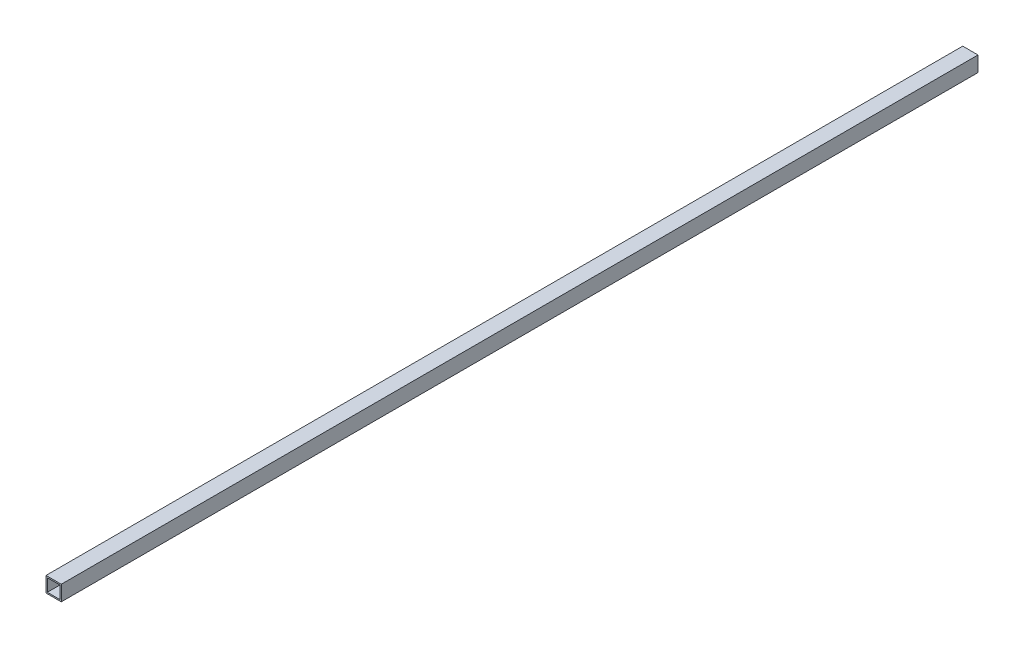
ISO-10303-21;
HEADER;
FILE_DESCRIPTION(('STEP AP214'),'2;1');
FILE_NAME('part.step','',(''),(''),'','','');
FILE_SCHEMA(('AUTOMOTIVE_DESIGN { 1 0 10303 214 1 1 1 1 }'));
ENDSEC;
DATA;
#1=APPLICATION_CONTEXT('core data for automotive mechanical design processes');
#2=APPLICATION_PROTOCOL_DEFINITION('international standard','automotive_design',2000,#1);
#3=PRODUCT_CONTEXT('',#1,'mechanical');
#4=PRODUCT('Part','Part','',(#3));
#5=PRODUCT_RELATED_PRODUCT_CATEGORY('part','',(#4));
#6=PRODUCT_DEFINITION_FORMATION('','',#4);
#7=PRODUCT_DEFINITION_CONTEXT('part definition',#1,'design');
#8=PRODUCT_DEFINITION('design','',#6,#7);
#9=PRODUCT_DEFINITION_SHAPE('','',#8);
#10=(LENGTH_UNIT() NAMED_UNIT(*) SI_UNIT(.MILLI.,.METRE.));
#11=(NAMED_UNIT(*) PLANE_ANGLE_UNIT() SI_UNIT($,.RADIAN.));
#12=(NAMED_UNIT(*) SI_UNIT($,.STERADIAN.) SOLID_ANGLE_UNIT());
#13=UNCERTAINTY_MEASURE_WITH_UNIT(LENGTH_MEASURE(1.E-05),#10,'distance_accuracy_value','');
#14=(GEOMETRIC_REPRESENTATION_CONTEXT(3) GLOBAL_UNCERTAINTY_ASSIGNED_CONTEXT((#13)) GLOBAL_UNIT_ASSIGNED_CONTEXT((#10,
#11,#12)) REPRESENTATION_CONTEXT('',''));
#15=CARTESIAN_POINT('',(0.,0.,0.));
#16=DIRECTION('',(0.,0.,1.));
#17=DIRECTION('',(1.,0.,0.));
#18=AXIS2_PLACEMENT_3D('',#15,#16,#17);
#19=CARTESIAN_POINT('',(0.,0.,1500.));
#20=DIRECTION('',(0.,0.,1.));
#21=DIRECTION('',(1.,0.,0.));
#22=AXIS2_PLACEMENT_3D('',#19,#20,#21);
#23=PLANE('',#22);
#24=DIRECTION('',(0.,-1.,0.));
#25=VECTOR('',#24,1.);
#26=CARTESIAN_POINT('',(-44.8874637947865,22.8146853146853,1500.));
#27=LINE('',#26,#25);
#28=CARTESIAN_POINT('',(-44.8874637947865,22.8146853146853,1500.));
#29=VERTEX_POINT('',#28);
#30=CARTESIAN_POINT('',(-44.8874637947865,-2.18531468531467,1500.));
#31=VERTEX_POINT('',#30);
#32=EDGE_CURVE('E158',#29,#31,#27,.T.);
#33=ORIENTED_EDGE('',*,*,#32,.T.);
#34=DIRECTION('',(1.,0.,0.));
#35=VECTOR('',#34,1.);
#36=CARTESIAN_POINT('',(-44.8874637947865,-2.18531468531467,1500.));
#37=LINE('',#36,#35);
#38=CARTESIAN_POINT('',(-19.8874637947865,-2.18531468531467,1500.));
#39=VERTEX_POINT('',#38);
#40=EDGE_CURVE('E161',#31,#39,#37,.T.);
#41=ORIENTED_EDGE('',*,*,#40,.T.);
#42=DIRECTION('',(0.,1.,0.));
#43=VECTOR('',#42,1.);
#44=CARTESIAN_POINT('',(-19.8874637947865,22.8146853146853,1500.));
#45=LINE('',#44,#43);
#46=CARTESIAN_POINT('',(-19.8874637947865,22.8146853146853,1500.));
#47=VERTEX_POINT('',#46);
#48=EDGE_CURVE('E164',#39,#47,#45,.T.);
#49=ORIENTED_EDGE('',*,*,#48,.T.);
#50=DIRECTION('',(-1.,0.,0.));
#51=VECTOR('',#50,1.);
#52=CARTESIAN_POINT('',(-44.8874637947865,22.8146853146853,1500.));
#53=LINE('',#52,#51);
#54=EDGE_CURVE('E166',#47,#29,#53,.T.);
#55=ORIENTED_EDGE('',*,*,#54,.T.);
#56=EDGE_LOOP('',(#33,#41,#49,#55));
#57=FACE_BOUND('',#56,.T.);
#58=DIRECTION('',(1.,0.,0.));
#59=VECTOR('',#58,1.);
#60=CARTESIAN_POINT('',(-44.8874637947865,0.0146853146853264,1500.));
#61=LINE('',#60,#59);
#62=CARTESIAN_POINT('',(-42.6874637947865,0.0146853146853264,1500.));
#63=VERTEX_POINT('',#62);
#64=CARTESIAN_POINT('',(-22.0874637947865,0.0146853146853264,1500.));
#65=VERTEX_POINT('',#64);
#66=EDGE_CURVE('E130',#63,#65,#61,.T.);
#67=ORIENTED_EDGE('',*,*,#66,.F.);
#68=DIRECTION('',(0.,-1.,0.));
#69=VECTOR('',#68,1.);
#70=CARTESIAN_POINT('',(-42.6874637947865,22.8146853146853,1500.));
#71=LINE('',#70,#69);
#72=CARTESIAN_POINT('',(-42.6874637947865,20.6146853146853,1500.));
#73=VERTEX_POINT('',#72);
#74=EDGE_CURVE('E122',#73,#63,#71,.T.);
#75=ORIENTED_EDGE('',*,*,#74,.F.);
#76=DIRECTION('',(-1.,0.,0.));
#77=VECTOR('',#76,1.);
#78=CARTESIAN_POINT('',(-44.8874637947865,20.6146853146853,1500.));
#79=LINE('',#78,#77);
#80=CARTESIAN_POINT('',(-22.0874637947865,20.6146853146853,1500.));
#81=VERTEX_POINT('',#80);
#82=EDGE_CURVE('E144',#81,#73,#79,.T.);
#83=ORIENTED_EDGE('',*,*,#82,.F.);
#84=DIRECTION('',(0.,1.,0.));
#85=VECTOR('',#84,1.);
#86=CARTESIAN_POINT('',(-22.0874637947865,22.8146853146853,1500.));
#87=LINE('',#86,#85);
#88=EDGE_CURVE('E142',#65,#81,#87,.T.);
#89=ORIENTED_EDGE('',*,*,#88,.F.);
#90=EDGE_LOOP('',(#67,#75,#83,#89));
#91=FACE_BOUND('',#90,.T.);
#92=ADVANCED_FACE('F57',(#57,#91),#23,.T.);
#93=CARTESIAN_POINT('',(0.,0.,0.));
#94=DIRECTION('',(0.,0.,1.));
#95=DIRECTION('',(1.,0.,0.));
#96=AXIS2_PLACEMENT_3D('',#93,#94,#95);
#97=PLANE('',#96);
#98=DIRECTION('',(0.,-1.,0.));
#99=VECTOR('',#98,1.);
#100=CARTESIAN_POINT('',(-44.8874637947865,22.8146853146853,0.));
#101=LINE('',#100,#99);
#102=CARTESIAN_POINT('',(-44.8874637947865,22.8146853146853,0.));
#103=VERTEX_POINT('',#102);
#104=CARTESIAN_POINT('',(-44.8874637947865,-2.18531468531467,0.));
#105=VERTEX_POINT('',#104);
#106=EDGE_CURVE('E138',#103,#105,#101,.T.);
#107=ORIENTED_EDGE('',*,*,#106,.F.);
#108=DIRECTION('',(-1.,0.,0.));
#109=VECTOR('',#108,1.);
#110=CARTESIAN_POINT('',(-44.8874637947865,22.8146853146853,0.));
#111=LINE('',#110,#109);
#112=CARTESIAN_POINT('',(-19.8874637947865,22.8146853146853,0.));
#113=VERTEX_POINT('',#112);
#114=EDGE_CURVE('E162',#113,#103,#111,.T.);
#115=ORIENTED_EDGE('',*,*,#114,.F.);
#116=DIRECTION('',(0.,1.,0.));
#117=VECTOR('',#116,1.);
#118=CARTESIAN_POINT('',(-19.8874637947865,22.8146853146853,0.));
#119=LINE('',#118,#117);
#120=CARTESIAN_POINT('',(-19.8874637947865,-2.18531468531467,0.));
#121=VERTEX_POINT('',#120);
#122=EDGE_CURVE('E173',#121,#113,#119,.T.);
#123=ORIENTED_EDGE('',*,*,#122,.F.);
#124=DIRECTION('',(1.,0.,0.));
#125=VECTOR('',#124,1.);
#126=CARTESIAN_POINT('',(-44.8874637947865,-2.18531468531467,0.));
#127=LINE('',#126,#125);
#128=EDGE_CURVE('E171',#105,#121,#127,.T.);
#129=ORIENTED_EDGE('',*,*,#128,.F.);
#130=EDGE_LOOP('',(#107,#115,#123,#129));
#131=FACE_BOUND('',#130,.T.);
#132=DIRECTION('',(0.,-1.,0.));
#133=VECTOR('',#132,1.);
#134=CARTESIAN_POINT('',(-42.6874637947865,22.8146853146853,0.));
#135=LINE('',#134,#133);
#136=CARTESIAN_POINT('',(-42.6874637947865,20.6146853146853,0.));
#137=VERTEX_POINT('',#136);
#138=CARTESIAN_POINT('',(-42.6874637947865,0.0146853146853264,0.));
#139=VERTEX_POINT('',#138);
#140=EDGE_CURVE('E80',#137,#139,#135,.T.);
#141=ORIENTED_EDGE('',*,*,#140,.T.);
#142=DIRECTION('',(1.,0.,0.));
#143=VECTOR('',#142,1.);
#144=CARTESIAN_POINT('',(-44.8874637947865,0.0146853146853264,0.));
#145=LINE('',#144,#143);
#146=CARTESIAN_POINT('',(-22.0874637947865,0.0146853146853264,0.));
#147=VERTEX_POINT('',#146);
#148=EDGE_CURVE('E137',#139,#147,#145,.T.);
#149=ORIENTED_EDGE('',*,*,#148,.T.);
#150=DIRECTION('',(0.,1.,0.));
#151=VECTOR('',#150,1.);
#152=CARTESIAN_POINT('',(-22.0874637947865,22.8146853146853,0.));
#153=LINE('',#152,#151);
#154=CARTESIAN_POINT('',(-22.0874637947865,20.6146853146853,0.));
#155=VERTEX_POINT('',#154);
#156=EDGE_CURVE('E150',#147,#155,#153,.T.);
#157=ORIENTED_EDGE('',*,*,#156,.T.);
#158=DIRECTION('',(-1.,0.,0.));
#159=VECTOR('',#158,1.);
#160=CARTESIAN_POINT('',(-44.8874637947865,20.6146853146853,0.));
#161=LINE('',#160,#159);
#162=EDGE_CURVE('E131',#155,#137,#161,.T.);
#163=ORIENTED_EDGE('',*,*,#162,.T.);
#164=EDGE_LOOP('',(#141,#149,#157,#163));
#165=FACE_BOUND('',#164,.T.);
#166=ADVANCED_FACE('F191',(#131,#165),#97,.F.);
#167=CARTESIAN_POINT('',(-44.8874637947865,22.8146853146853,1500.));
#168=DIRECTION('',(1.,0.,0.));
#169=DIRECTION('',(0.,0.,-1.));
#170=AXIS2_PLACEMENT_3D('',#167,#168,#169);
#171=PLANE('',#170);
#172=ORIENTED_EDGE('',*,*,#106,.T.);
#173=DIRECTION('',(0.,0.,-1.));
#174=VECTOR('',#173,1.);
#175=CARTESIAN_POINT('',(-44.8874637947865,-2.18531468531467,1500.));
#176=LINE('',#175,#174);
#177=EDGE_CURVE('E12',#31,#105,#176,.T.);
#178=ORIENTED_EDGE('',*,*,#177,.F.);
#179=ORIENTED_EDGE('',*,*,#32,.F.);
#180=DIRECTION('',(0.,0.,-1.));
#181=VECTOR('',#180,1.);
#182=CARTESIAN_POINT('',(-44.8874637947865,22.8146853146853,1500.));
#183=LINE('',#182,#181);
#184=EDGE_CURVE('E168',#29,#103,#183,.T.);
#185=ORIENTED_EDGE('',*,*,#184,.T.);
#186=EDGE_LOOP('',(#172,#178,#179,#185));
#187=FACE_BOUND('',#186,.T.);
#188=ADVANCED_FACE('F59',(#187),#171,.F.);
#189=CARTESIAN_POINT('',(-44.8874637947865,-2.18531468531467,1500.));
#190=DIRECTION('',(0.,1.,0.));
#191=DIRECTION('',(0.,0.,1.));
#192=AXIS2_PLACEMENT_3D('',#189,#190,#191);
#193=PLANE('',#192);
#194=ORIENTED_EDGE('',*,*,#128,.T.);
#195=DIRECTION('',(0.,0.,-1.));
#196=VECTOR('',#195,1.);
#197=CARTESIAN_POINT('',(-19.8874637947865,-2.18531468531467,1500.));
#198=LINE('',#197,#196);
#199=EDGE_CURVE('E65',#39,#121,#198,.T.);
#200=ORIENTED_EDGE('',*,*,#199,.F.);
#201=ORIENTED_EDGE('',*,*,#40,.F.);
#202=ORIENTED_EDGE('',*,*,#177,.T.);
#203=EDGE_LOOP('',(#194,#200,#201,#202));
#204=FACE_BOUND('',#203,.T.);
#205=ADVANCED_FACE('F201',(#204),#193,.F.);
#206=CARTESIAN_POINT('',(-19.8874637947865,22.8146853146853,1500.));
#207=DIRECTION('',(-1.,0.,0.));
#208=DIRECTION('',(0.,-1.,0.));
#209=AXIS2_PLACEMENT_3D('',#206,#207,#208);
#210=PLANE('',#209);
#211=ORIENTED_EDGE('',*,*,#122,.T.);
#212=DIRECTION('',(0.,0.,-1.));
#213=VECTOR('',#212,1.);
#214=CARTESIAN_POINT('',(-19.8874637947865,22.8146853146853,1500.));
#215=LINE('',#214,#213);
#216=EDGE_CURVE('E178',#47,#113,#215,.T.);
#217=ORIENTED_EDGE('',*,*,#216,.F.);
#218=ORIENTED_EDGE('',*,*,#48,.F.);
#219=ORIENTED_EDGE('',*,*,#199,.T.);
#220=EDGE_LOOP('',(#211,#217,#218,#219));
#221=FACE_BOUND('',#220,.T.);
#222=ADVANCED_FACE('F185',(#221),#210,.F.);
#223=CARTESIAN_POINT('',(-44.8874637947865,22.8146853146853,1500.));
#224=DIRECTION('',(0.,-1.,0.));
#225=DIRECTION('',(0.,0.,-1.));
#226=AXIS2_PLACEMENT_3D('',#223,#224,#225);
#227=PLANE('',#226);
#228=ORIENTED_EDGE('',*,*,#114,.T.);
#229=ORIENTED_EDGE('',*,*,#184,.F.);
#230=ORIENTED_EDGE('',*,*,#54,.F.);
#231=ORIENTED_EDGE('',*,*,#216,.T.);
#232=EDGE_LOOP('',(#228,#229,#230,#231));
#233=FACE_BOUND('',#232,.T.);
#234=ADVANCED_FACE('F195',(#233),#227,.F.);
#235=CARTESIAN_POINT('',(-42.6874637947865,22.8146853146853,1500.));
#236=DIRECTION('',(1.,0.,0.));
#237=DIRECTION('',(0.,0.,-1.));
#238=AXIS2_PLACEMENT_3D('',#235,#236,#237);
#239=PLANE('',#238);
#240=ORIENTED_EDGE('',*,*,#140,.F.);
#241=DIRECTION('',(0.,0.,-1.));
#242=VECTOR('',#241,1.);
#243=CARTESIAN_POINT('',(-42.6874637947865,20.6146853146853,1500.));
#244=LINE('',#243,#242);
#245=EDGE_CURVE('E126',#73,#137,#244,.T.);
#246=ORIENTED_EDGE('',*,*,#245,.F.);
#247=ORIENTED_EDGE('',*,*,#74,.T.);
#248=DIRECTION('',(0.,0.,-1.));
#249=VECTOR('',#248,1.);
#250=CARTESIAN_POINT('',(-42.6874637947865,0.0146853146853264,1500.));
#251=LINE('',#250,#249);
#252=EDGE_CURVE('E125',#63,#139,#251,.T.);
#253=ORIENTED_EDGE('',*,*,#252,.T.);
#254=EDGE_LOOP('',(#240,#246,#247,#253));
#255=FACE_BOUND('',#254,.T.);
#256=ADVANCED_FACE('F124',(#255),#239,.T.);
#257=CARTESIAN_POINT('',(-44.8874637947865,0.0146853146853264,1500.));
#258=DIRECTION('',(0.,1.,0.));
#259=DIRECTION('',(0.,0.,1.));
#260=AXIS2_PLACEMENT_3D('',#257,#258,#259);
#261=PLANE('',#260);
#262=ORIENTED_EDGE('',*,*,#148,.F.);
#263=ORIENTED_EDGE('',*,*,#252,.F.);
#264=ORIENTED_EDGE('',*,*,#66,.T.);
#265=DIRECTION('',(0.,0.,-1.));
#266=VECTOR('',#265,1.);
#267=CARTESIAN_POINT('',(-22.0874637947865,0.0146853146853264,1500.));
#268=LINE('',#267,#266);
#269=EDGE_CURVE('E139',#65,#147,#268,.T.);
#270=ORIENTED_EDGE('',*,*,#269,.T.);
#271=EDGE_LOOP('',(#262,#263,#264,#270));
#272=FACE_BOUND('',#271,.T.);
#273=ADVANCED_FACE('F134',(#272),#261,.T.);
#274=CARTESIAN_POINT('',(-22.0874637947865,22.8146853146853,1500.));
#275=DIRECTION('',(-1.,0.,0.));
#276=DIRECTION('',(0.,-1.,0.));
#277=AXIS2_PLACEMENT_3D('',#274,#275,#276);
#278=PLANE('',#277);
#279=ORIENTED_EDGE('',*,*,#156,.F.);
#280=ORIENTED_EDGE('',*,*,#269,.F.);
#281=ORIENTED_EDGE('',*,*,#88,.T.);
#282=DIRECTION('',(0.,0.,-1.));
#283=VECTOR('',#282,1.);
#284=CARTESIAN_POINT('',(-22.0874637947865,20.6146853146853,1500.));
#285=LINE('',#284,#283);
#286=EDGE_CURVE('E72',#81,#155,#285,.T.);
#287=ORIENTED_EDGE('',*,*,#286,.T.);
#288=EDGE_LOOP('',(#279,#280,#281,#287));
#289=FACE_BOUND('',#288,.T.);
#290=ADVANCED_FACE('F224',(#289),#278,.T.);
#291=CARTESIAN_POINT('',(-44.8874637947865,20.6146853146853,1500.));
#292=DIRECTION('',(0.,-1.,0.));
#293=DIRECTION('',(0.,0.,-1.));
#294=AXIS2_PLACEMENT_3D('',#291,#292,#293);
#295=PLANE('',#294);
#296=ORIENTED_EDGE('',*,*,#162,.F.);
#297=ORIENTED_EDGE('',*,*,#286,.F.);
#298=ORIENTED_EDGE('',*,*,#82,.T.);
#299=ORIENTED_EDGE('',*,*,#245,.T.);
#300=EDGE_LOOP('',(#296,#297,#298,#299));
#301=FACE_BOUND('',#300,.T.);
#302=ADVANCED_FACE('F228',(#301),#295,.T.);
#303=CLOSED_SHELL('',(#92,#166,#188,#205,#222,#234,#256,#273,#290,#302));
#304=MANIFOLD_SOLID_BREP('B2',#303);
#305=ADVANCED_BREP_SHAPE_REPRESENTATION('',(#18,#304),#14);
#306=SHAPE_DEFINITION_REPRESENTATION(#9,#305);
ENDSEC;
END-ISO-10303-21;
